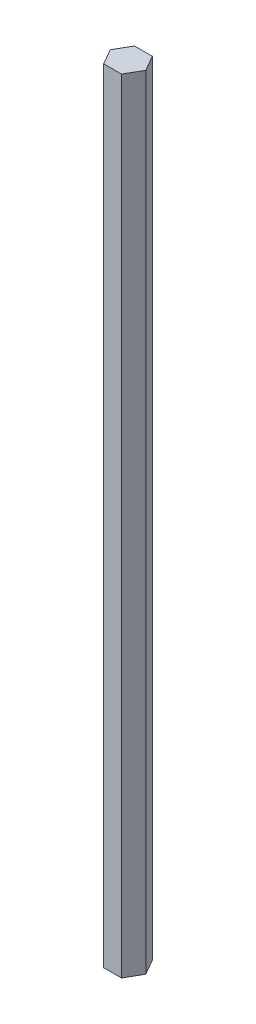
ISO-10303-21;
HEADER;
FILE_DESCRIPTION(('STEP AP214'),'2;1');
FILE_NAME('part.step','',(''),(''),'','','');
FILE_SCHEMA(('AUTOMOTIVE_DESIGN { 1 0 10303 214 1 1 1 1 }'));
ENDSEC;
DATA;
#1=APPLICATION_CONTEXT('core data for automotive mechanical design processes');
#2=APPLICATION_PROTOCOL_DEFINITION('international standard','automotive_design',2000,#1);
#3=PRODUCT_CONTEXT('',#1,'mechanical');
#4=PRODUCT('Part','Part','',(#3));
#5=PRODUCT_RELATED_PRODUCT_CATEGORY('part','',(#4));
#6=PRODUCT_DEFINITION_FORMATION('','',#4);
#7=PRODUCT_DEFINITION_CONTEXT('part definition',#1,'design');
#8=PRODUCT_DEFINITION('design','',#6,#7);
#9=PRODUCT_DEFINITION_SHAPE('','',#8);
#10=(LENGTH_UNIT() NAMED_UNIT(*) SI_UNIT(.MILLI.,.METRE.));
#11=(NAMED_UNIT(*) PLANE_ANGLE_UNIT() SI_UNIT($,.RADIAN.));
#12=(NAMED_UNIT(*) SI_UNIT($,.STERADIAN.) SOLID_ANGLE_UNIT());
#13=UNCERTAINTY_MEASURE_WITH_UNIT(LENGTH_MEASURE(1.E-05),#10,'distance_accuracy_value','');
#14=(GEOMETRIC_REPRESENTATION_CONTEXT(3) GLOBAL_UNCERTAINTY_ASSIGNED_CONTEXT((#13)) GLOBAL_UNIT_ASSIGNED_CONTEXT((#10,
#11,#12)) REPRESENTATION_CONTEXT('',''));
#15=CARTESIAN_POINT('',(0.,0.,0.));
#16=DIRECTION('',(0.,0.,1.));
#17=DIRECTION('',(1.,0.,0.));
#18=AXIS2_PLACEMENT_3D('',#15,#16,#17);
#19=CARTESIAN_POINT('',(3.97705905170191,352.,5.34885921686965));
#20=DIRECTION('',(-0.866025403784439,0.,-0.5));
#21=DIRECTION('',(-0.5,0.,0.866025403784439));
#22=AXIS2_PLACEMENT_3D('',#19,#20,#21);
#23=PLANE('',#22);
#24=DIRECTION('',(0.5,0.,-0.866025403784439));
#25=VECTOR('',#24,1.);
#26=CARTESIAN_POINT('',(3.97705905170191,0.,5.34885921686965));
#27=LINE('',#26,#25);
#28=CARTESIAN_POINT('',(3.97705905170191,0.,5.34885921686965));
#29=VERTEX_POINT('',#28);
#30=CARTESIAN_POINT('',(7.97705905170191,0.,-1.57934401340586));
#31=VERTEX_POINT('',#30);
#32=EDGE_CURVE('E123',#29,#31,#27,.T.);
#33=ORIENTED_EDGE('',*,*,#32,.T.);
#34=DIRECTION('',(0.,-1.,0.));
#35=VECTOR('',#34,1.);
#36=CARTESIAN_POINT('',(7.97705905170191,352.,-1.57934401340586));
#37=LINE('',#36,#35);
#38=CARTESIAN_POINT('',(7.97705905170191,352.,-1.57934401340586));
#39=VERTEX_POINT('',#38);
#40=EDGE_CURVE('E11',#39,#31,#37,.T.);
#41=ORIENTED_EDGE('',*,*,#40,.F.);
#42=DIRECTION('',(0.5,0.,-0.866025403784439));
#43=VECTOR('',#42,1.);
#44=CARTESIAN_POINT('',(3.97705905170191,352.,5.34885921686965));
#45=LINE('',#44,#43);
#46=CARTESIAN_POINT('',(3.97705905170191,352.,5.34885921686965));
#47=VERTEX_POINT('',#46);
#48=EDGE_CURVE('E133',#47,#39,#45,.T.);
#49=ORIENTED_EDGE('',*,*,#48,.F.);
#50=DIRECTION('',(0.,-1.,0.));
#51=VECTOR('',#50,1.);
#52=CARTESIAN_POINT('',(3.97705905170191,352.,5.34885921686965));
#53=LINE('',#52,#51);
#54=EDGE_CURVE('E119',#47,#29,#53,.T.);
#55=ORIENTED_EDGE('',*,*,#54,.T.);
#56=EDGE_LOOP('',(#33,#41,#49,#55));
#57=FACE_BOUND('',#56,.T.);
#58=ADVANCED_FACE('F39',(#57),#23,.F.);
#59=CARTESIAN_POINT('',(7.97705905170191,352.,-1.57934401340586));
#60=DIRECTION('',(-0.866025403784439,0.,0.5));
#61=DIRECTION('',(0.5,0.,0.866025403784439));
#62=AXIS2_PLACEMENT_3D('',#59,#60,#61);
#63=PLANE('',#62);
#64=DIRECTION('',(-0.5,0.,-0.866025403784439));
#65=VECTOR('',#64,1.);
#66=CARTESIAN_POINT('',(7.97705905170191,0.,-1.57934401340586));
#67=LINE('',#66,#65);
#68=CARTESIAN_POINT('',(3.97705905170191,0.,-8.50754724368137));
#69=VERTEX_POINT('',#68);
#70=EDGE_CURVE('E126',#31,#69,#67,.T.);
#71=ORIENTED_EDGE('',*,*,#70,.T.);
#72=DIRECTION('',(0.,-1.,0.));
#73=VECTOR('',#72,1.);
#74=CARTESIAN_POINT('',(3.97705905170191,352.,-8.50754724368137));
#75=LINE('',#74,#73);
#76=CARTESIAN_POINT('',(3.97705905170191,352.,-8.50754724368137));
#77=VERTEX_POINT('',#76);
#78=EDGE_CURVE('E47',#77,#69,#75,.T.);
#79=ORIENTED_EDGE('',*,*,#78,.F.);
#80=DIRECTION('',(-0.5,0.,-0.866025403784439));
#81=VECTOR('',#80,1.);
#82=CARTESIAN_POINT('',(7.97705905170191,352.,-1.57934401340586));
#83=LINE('',#82,#81);
#84=EDGE_CURVE('E92',#39,#77,#83,.T.);
#85=ORIENTED_EDGE('',*,*,#84,.F.);
#86=ORIENTED_EDGE('',*,*,#40,.T.);
#87=EDGE_LOOP('',(#71,#79,#85,#86));
#88=FACE_BOUND('',#87,.T.);
#89=ADVANCED_FACE('F157',(#88),#63,.F.);
#90=CARTESIAN_POINT('',(3.97705905170191,352.,-8.50754724368137));
#91=DIRECTION('',(0.,0.,1.));
#92=DIRECTION('',(1.,0.,0.));
#93=AXIS2_PLACEMENT_3D('',#90,#91,#92);
#94=PLANE('',#93);
#95=DIRECTION('',(-1.,0.,0.));
#96=VECTOR('',#95,1.);
#97=CARTESIAN_POINT('',(3.97705905170191,0.,-8.50754724368137));
#98=LINE('',#97,#96);
#99=CARTESIAN_POINT('',(-4.02294094829809,0.,-8.50754724368137));
#100=VERTEX_POINT('',#99);
#101=EDGE_CURVE('E128',#69,#100,#98,.T.);
#102=ORIENTED_EDGE('',*,*,#101,.T.);
#103=DIRECTION('',(0.,-1.,0.));
#104=VECTOR('',#103,1.);
#105=CARTESIAN_POINT('',(-4.02294094829809,352.,-8.50754724368137));
#106=LINE('',#105,#104);
#107=CARTESIAN_POINT('',(-4.02294094829809,352.,-8.50754724368137));
#108=VERTEX_POINT('',#107);
#109=EDGE_CURVE('E114',#108,#100,#106,.T.);
#110=ORIENTED_EDGE('',*,*,#109,.F.);
#111=DIRECTION('',(-1.,0.,0.));
#112=VECTOR('',#111,1.);
#113=CARTESIAN_POINT('',(3.97705905170191,352.,-8.50754724368137));
#114=LINE('',#113,#112);
#115=EDGE_CURVE('E105',#77,#108,#114,.T.);
#116=ORIENTED_EDGE('',*,*,#115,.F.);
#117=ORIENTED_EDGE('',*,*,#78,.T.);
#118=EDGE_LOOP('',(#102,#110,#116,#117));
#119=FACE_BOUND('',#118,.T.);
#120=ADVANCED_FACE('F139',(#119),#94,.F.);
#121=CARTESIAN_POINT('',(-4.02294094829809,352.,-8.50754724368137));
#122=DIRECTION('',(0.866025403784439,0.,0.5));
#123=DIRECTION('',(0.5,0.,-0.866025403784439));
#124=AXIS2_PLACEMENT_3D('',#121,#122,#123);
#125=PLANE('',#124);
#126=DIRECTION('',(-0.5,0.,0.866025403784439));
#127=VECTOR('',#126,1.);
#128=CARTESIAN_POINT('',(-4.02294094829809,0.,-8.50754724368137));
#129=LINE('',#128,#127);
#130=CARTESIAN_POINT('',(-8.02294094829809,0.,-1.57934401340586));
#131=VERTEX_POINT('',#130);
#132=EDGE_CURVE('E113',#100,#131,#129,.T.);
#133=ORIENTED_EDGE('',*,*,#132,.T.);
#134=DIRECTION('',(0.,-1.,0.));
#135=VECTOR('',#134,1.);
#136=CARTESIAN_POINT('',(-8.02294094829809,352.,-1.57934401340586));
#137=LINE('',#136,#135);
#138=CARTESIAN_POINT('',(-8.02294094829809,352.,-1.57934401340586));
#139=VERTEX_POINT('',#138);
#140=EDGE_CURVE('E110',#139,#131,#137,.T.);
#141=ORIENTED_EDGE('',*,*,#140,.F.);
#142=DIRECTION('',(-0.5,0.,0.866025403784439));
#143=VECTOR('',#142,1.);
#144=CARTESIAN_POINT('',(-4.02294094829809,352.,-8.50754724368137));
#145=LINE('',#144,#143);
#146=EDGE_CURVE('E99',#108,#139,#145,.T.);
#147=ORIENTED_EDGE('',*,*,#146,.F.);
#148=ORIENTED_EDGE('',*,*,#109,.T.);
#149=EDGE_LOOP('',(#133,#141,#147,#148));
#150=FACE_BOUND('',#149,.T.);
#151=ADVANCED_FACE('F111',(#150),#125,.F.);
#152=CARTESIAN_POINT('',(-8.02294094829809,352.,-1.57934401340586));
#153=DIRECTION('',(0.866025403784438,0.,-0.500000000000001));
#154=DIRECTION('',(-0.500000000000001,0.,-0.866025403784438));
#155=AXIS2_PLACEMENT_3D('',#152,#153,#154);
#156=PLANE('',#155);
#157=DIRECTION('',(0.500000000000001,0.,0.866025403784438));
#158=VECTOR('',#157,1.);
#159=CARTESIAN_POINT('',(-8.02294094829809,0.,-1.57934401340586));
#160=LINE('',#159,#158);
#161=CARTESIAN_POINT('',(-4.02294094829809,0.,5.34885921686965));
#162=VERTEX_POINT('',#161);
#163=EDGE_CURVE('E78',#131,#162,#160,.T.);
#164=ORIENTED_EDGE('',*,*,#163,.T.);
#165=DIRECTION('',(0.,-1.,0.));
#166=VECTOR('',#165,1.);
#167=CARTESIAN_POINT('',(-4.02294094829809,352.,5.34885921686965));
#168=LINE('',#167,#166);
#169=CARTESIAN_POINT('',(-4.02294094829809,352.,5.34885921686965));
#170=VERTEX_POINT('',#169);
#171=EDGE_CURVE('E115',#170,#162,#168,.T.);
#172=ORIENTED_EDGE('',*,*,#171,.F.);
#173=DIRECTION('',(0.500000000000001,0.,0.866025403784438));
#174=VECTOR('',#173,1.);
#175=CARTESIAN_POINT('',(-8.02294094829809,352.,-1.57934401340586));
#176=LINE('',#175,#174);
#177=EDGE_CURVE('E103',#139,#170,#176,.T.);
#178=ORIENTED_EDGE('',*,*,#177,.F.);
#179=ORIENTED_EDGE('',*,*,#140,.T.);
#180=EDGE_LOOP('',(#164,#172,#178,#179));
#181=FACE_BOUND('',#180,.T.);
#182=ADVANCED_FACE('F117',(#181),#156,.F.);
#183=CARTESIAN_POINT('',(-4.02294094829809,352.,5.34885921686965));
#184=DIRECTION('',(0.,0.,-1.));
#185=DIRECTION('',(-1.,0.,0.));
#186=AXIS2_PLACEMENT_3D('',#183,#184,#185);
#187=PLANE('',#186);
#188=DIRECTION('',(1.,0.,0.));
#189=VECTOR('',#188,1.);
#190=CARTESIAN_POINT('',(-4.02294094829809,0.,5.34885921686965));
#191=LINE('',#190,#189);
#192=EDGE_CURVE('E84',#162,#29,#191,.T.);
#193=ORIENTED_EDGE('',*,*,#192,.T.);
#194=ORIENTED_EDGE('',*,*,#54,.F.);
#195=DIRECTION('',(1.,0.,0.));
#196=VECTOR('',#195,1.);
#197=CARTESIAN_POINT('',(-4.02294094829809,352.,5.34885921686965));
#198=LINE('',#197,#196);
#199=EDGE_CURVE('E55',#170,#47,#198,.T.);
#200=ORIENTED_EDGE('',*,*,#199,.F.);
#201=ORIENTED_EDGE('',*,*,#171,.T.);
#202=EDGE_LOOP('',(#193,#194,#200,#201));
#203=FACE_BOUND('',#202,.T.);
#204=ADVANCED_FACE('F146',(#203),#187,.F.);
#205=CARTESIAN_POINT('',(0.,352.,0.));
#206=DIRECTION('',(0.,1.,0.));
#207=DIRECTION('',(0.,0.,1.));
#208=AXIS2_PLACEMENT_3D('',#205,#206,#207);
#209=PLANE('',#208);
#210=ORIENTED_EDGE('',*,*,#48,.T.);
#211=ORIENTED_EDGE('',*,*,#84,.T.);
#212=ORIENTED_EDGE('',*,*,#115,.T.);
#213=ORIENTED_EDGE('',*,*,#146,.T.);
#214=ORIENTED_EDGE('',*,*,#177,.T.);
#215=ORIENTED_EDGE('',*,*,#199,.T.);
#216=EDGE_LOOP('',(#210,#211,#212,#213,#214,#215));
#217=FACE_BOUND('',#216,.T.);
#218=ADVANCED_FACE('F101',(#217),#209,.T.);
#219=CARTESIAN_POINT('',(0.,0.,0.));
#220=DIRECTION('',(0.,1.,0.));
#221=DIRECTION('',(0.,0.,1.));
#222=AXIS2_PLACEMENT_3D('',#219,#220,#221);
#223=PLANE('',#222);
#224=ORIENTED_EDGE('',*,*,#32,.F.);
#225=ORIENTED_EDGE('',*,*,#192,.F.);
#226=ORIENTED_EDGE('',*,*,#163,.F.);
#227=ORIENTED_EDGE('',*,*,#132,.F.);
#228=ORIENTED_EDGE('',*,*,#101,.F.);
#229=ORIENTED_EDGE('',*,*,#70,.F.);
#230=EDGE_LOOP('',(#224,#225,#226,#227,#228,#229));
#231=FACE_BOUND('',#230,.T.);
#232=ADVANCED_FACE('F142',(#231),#223,.F.);
#233=CLOSED_SHELL('',(#58,#89,#120,#151,#182,#204,#218,#232));
#234=MANIFOLD_SOLID_BREP('B2',#233);
#235=ADVANCED_BREP_SHAPE_REPRESENTATION('',(#18,#234),#14);
#236=SHAPE_DEFINITION_REPRESENTATION(#9,#235);
ENDSEC;
END-ISO-10303-21;
